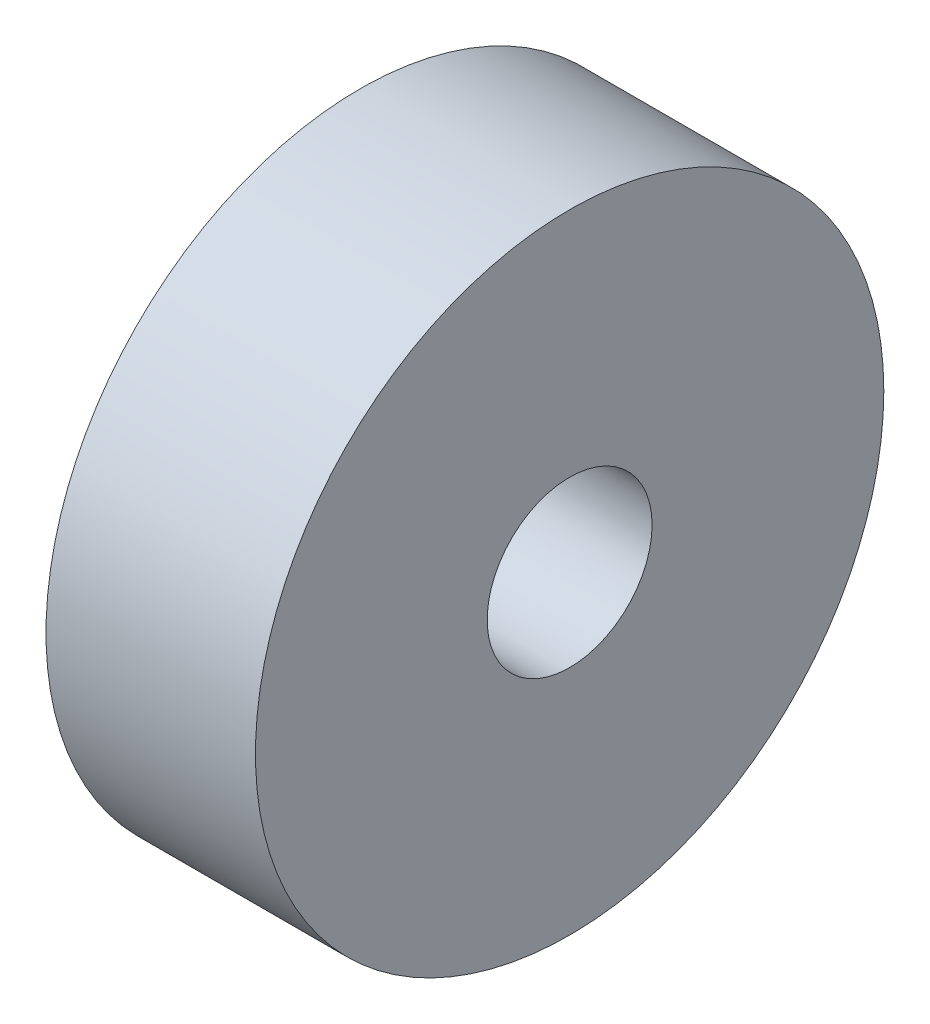
ISO-10303-21;
HEADER;
FILE_DESCRIPTION(('STEP AP214'),'2;1');
FILE_NAME('part.step','',(''),(''),'','','');
FILE_SCHEMA(('AUTOMOTIVE_DESIGN { 1 0 10303 214 1 1 1 1 }'));
ENDSEC;
DATA;
#1=APPLICATION_CONTEXT('core data for automotive mechanical design processes');
#2=APPLICATION_PROTOCOL_DEFINITION('international standard','automotive_design',2000,#1);
#3=PRODUCT_CONTEXT('',#1,'mechanical');
#4=PRODUCT('Part','Part','',(#3));
#5=PRODUCT_RELATED_PRODUCT_CATEGORY('part','',(#4));
#6=PRODUCT_DEFINITION_FORMATION('','',#4);
#7=PRODUCT_DEFINITION_CONTEXT('part definition',#1,'design');
#8=PRODUCT_DEFINITION('design','',#6,#7);
#9=PRODUCT_DEFINITION_SHAPE('','',#8);
#10=(LENGTH_UNIT() NAMED_UNIT(*) SI_UNIT(.MILLI.,.METRE.));
#11=(NAMED_UNIT(*) PLANE_ANGLE_UNIT() SI_UNIT($,.RADIAN.));
#12=(NAMED_UNIT(*) SI_UNIT($,.STERADIAN.) SOLID_ANGLE_UNIT());
#13=UNCERTAINTY_MEASURE_WITH_UNIT(LENGTH_MEASURE(1.E-05),#10,'distance_accuracy_value','');
#14=(GEOMETRIC_REPRESENTATION_CONTEXT(3) GLOBAL_UNCERTAINTY_ASSIGNED_CONTEXT((#13)) GLOBAL_UNIT_ASSIGNED_CONTEXT((#10,
#11,#12)) REPRESENTATION_CONTEXT('',''));
#15=CARTESIAN_POINT('',(0.,0.,0.));
#16=DIRECTION('',(0.,0.,1.));
#17=DIRECTION('',(1.,0.,0.));
#18=AXIS2_PLACEMENT_3D('',#15,#16,#17);
#19=CARTESIAN_POINT('',(12.7,0.,0.));
#20=DIRECTION('',(1.,0.,0.));
#21=DIRECTION('',(0.,0.,-1.));
#22=AXIS2_PLACEMENT_3D('',#19,#20,#21);
#23=PLANE('',#22);
#24=CARTESIAN_POINT('',(12.7,0.,0.));
#25=DIRECTION('',(1.,0.,0.));
#26=DIRECTION('',(0.,0.,-1.));
#27=AXIS2_PLACEMENT_3D('',#24,#25,#26);
#28=CIRCLE('',#27,19.05);
#29=CARTESIAN_POINT('',(12.7,0.,-19.05));
#30=VERTEX_POINT('',#29);
#31=EDGE_CURVE('E10',#30,#30,#28,.T.);
#32=ORIENTED_EDGE('',*,*,#31,.T.);
#33=EDGE_LOOP('',(#32));
#34=FACE_BOUND('',#33,.T.);
#35=CARTESIAN_POINT('',(12.7,0.,0.));
#36=DIRECTION('',(1.,0.,0.));
#37=DIRECTION('',(0.,0.,-1.));
#38=AXIS2_PLACEMENT_3D('',#35,#36,#37);
#39=CIRCLE('',#38,5.);
#40=CARTESIAN_POINT('',(12.7,0.,-5.));
#41=VERTEX_POINT('',#40);
#42=EDGE_CURVE('E50',#41,#41,#39,.T.);
#43=ORIENTED_EDGE('',*,*,#42,.F.);
#44=EDGE_LOOP('',(#43));
#45=FACE_BOUND('',#44,.T.);
#46=ADVANCED_FACE('F37',(#34,#45),#23,.T.);
#47=CARTESIAN_POINT('',(0.,0.,0.));
#48=DIRECTION('',(1.,0.,0.));
#49=DIRECTION('',(0.,0.,-1.));
#50=AXIS2_PLACEMENT_3D('',#47,#48,#49);
#51=PLANE('',#50);
#52=CARTESIAN_POINT('',(0.,0.,0.));
#53=DIRECTION('',(1.,0.,0.));
#54=DIRECTION('',(0.,0.,-1.));
#55=AXIS2_PLACEMENT_3D('',#52,#53,#54);
#56=CIRCLE('',#55,19.05);
#57=CARTESIAN_POINT('',(0.,0.,-19.05));
#58=VERTEX_POINT('',#57);
#59=EDGE_CURVE('E41',#58,#58,#56,.T.);
#60=ORIENTED_EDGE('',*,*,#59,.F.);
#61=EDGE_LOOP('',(#60));
#62=FACE_BOUND('',#61,.T.);
#63=CARTESIAN_POINT('',(0.,0.,0.));
#64=DIRECTION('',(1.,0.,0.));
#65=DIRECTION('',(0.,0.,-1.));
#66=AXIS2_PLACEMENT_3D('',#63,#64,#65);
#67=CIRCLE('',#66,5.);
#68=CARTESIAN_POINT('',(0.,0.,-5.));
#69=VERTEX_POINT('',#68);
#70=EDGE_CURVE('E52',#69,#69,#67,.T.);
#71=ORIENTED_EDGE('',*,*,#70,.T.);
#72=EDGE_LOOP('',(#71));
#73=FACE_BOUND('',#72,.T.);
#74=ADVANCED_FACE('F64',(#62,#73),#51,.F.);
#75=CARTESIAN_POINT('',(12.7,0.,0.));
#76=DIRECTION('',(-1.,0.,0.));
#77=DIRECTION('',(0.,0.,1.));
#78=AXIS2_PLACEMENT_3D('',#75,#76,#77);
#79=CYLINDRICAL_SURFACE('',#78,19.05);
#80=ORIENTED_EDGE('',*,*,#31,.F.);
#81=EDGE_LOOP('',(#80));
#82=FACE_BOUND('',#81,.T.);
#83=ORIENTED_EDGE('',*,*,#59,.T.);
#84=EDGE_LOOP('',(#83));
#85=FACE_BOUND('',#84,.T.);
#86=ADVANCED_FACE('F39',(#82,#85),#79,.T.);
#87=CARTESIAN_POINT('',(12.7,0.,0.));
#88=DIRECTION('',(-1.,0.,0.));
#89=DIRECTION('',(0.,0.,1.));
#90=AXIS2_PLACEMENT_3D('',#87,#88,#89);
#91=CYLINDRICAL_SURFACE('',#90,5.);
#92=ORIENTED_EDGE('',*,*,#42,.T.);
#93=EDGE_LOOP('',(#92));
#94=FACE_BOUND('',#93,.T.);
#95=ORIENTED_EDGE('',*,*,#70,.F.);
#96=EDGE_LOOP('',(#95));
#97=FACE_BOUND('',#96,.T.);
#98=ADVANCED_FACE('F60',(#94,#97),#91,.F.);
#99=CLOSED_SHELL('',(#46,#74,#86,#98));
#100=MANIFOLD_SOLID_BREP('B2',#99);
#101=ADVANCED_BREP_SHAPE_REPRESENTATION('',(#18,#100),#14);
#102=SHAPE_DEFINITION_REPRESENTATION(#9,#101);
ENDSEC;
END-ISO-10303-21;
